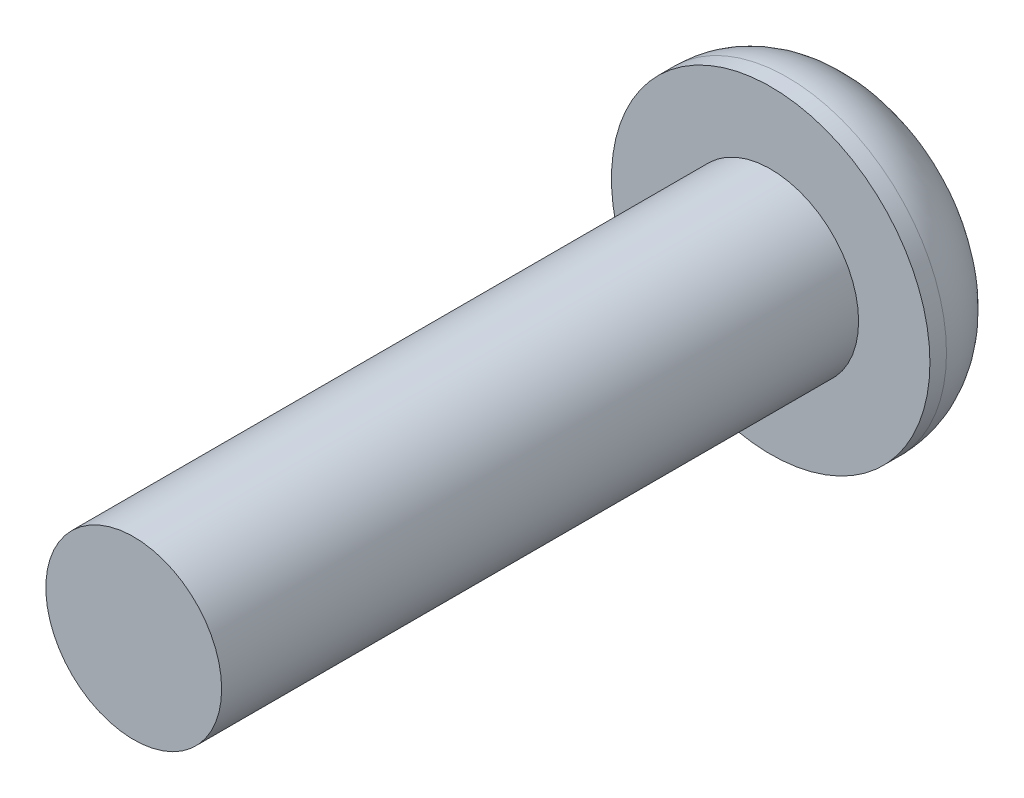
ISO-10303-21;
HEADER;
FILE_DESCRIPTION(('STEP AP214'),'2;1');
FILE_NAME('part.step','',(''),(''),'','','');
FILE_SCHEMA(('AUTOMOTIVE_DESIGN { 1 0 10303 214 1 1 1 1 }'));
ENDSEC;
DATA;
#1=APPLICATION_CONTEXT('core data for automotive mechanical design processes');
#2=APPLICATION_PROTOCOL_DEFINITION('international standard','automotive_design',2000,#1);
#3=PRODUCT_CONTEXT('',#1,'mechanical');
#4=PRODUCT('Part','Part','',(#3));
#5=PRODUCT_RELATED_PRODUCT_CATEGORY('part','',(#4));
#6=PRODUCT_DEFINITION_FORMATION('','',#4);
#7=PRODUCT_DEFINITION_CONTEXT('part definition',#1,'design');
#8=PRODUCT_DEFINITION('design','',#6,#7);
#9=PRODUCT_DEFINITION_SHAPE('','',#8);
#10=(LENGTH_UNIT() NAMED_UNIT(*) SI_UNIT(.MILLI.,.METRE.));
#11=(NAMED_UNIT(*) PLANE_ANGLE_UNIT() SI_UNIT($,.RADIAN.));
#12=(NAMED_UNIT(*) SI_UNIT($,.STERADIAN.) SOLID_ANGLE_UNIT());
#13=UNCERTAINTY_MEASURE_WITH_UNIT(LENGTH_MEASURE(1.E-05),#10,'distance_accuracy_value','');
#14=(GEOMETRIC_REPRESENTATION_CONTEXT(3) GLOBAL_UNCERTAINTY_ASSIGNED_CONTEXT((#13)) GLOBAL_UNIT_ASSIGNED_CONTEXT((#10,
#11,#12)) REPRESENTATION_CONTEXT('',''));
#15=CARTESIAN_POINT('',(0.,0.,0.));
#16=DIRECTION('',(0.,0.,1.));
#17=DIRECTION('',(1.,0.,0.));
#18=AXIS2_PLACEMENT_3D('',#15,#16,#17);
#19=CARTESIAN_POINT('',(0.,0.,1.8542));
#20=DIRECTION('',(0.,0.,1.));
#21=DIRECTION('',(1.,0.,0.));
#22=AXIS2_PLACEMENT_3D('',#19,#20,#21);
#23=PLANE('',#22);
#24=CARTESIAN_POINT('',(0.,0.,1.8542));
#25=DIRECTION('',(0.,0.,1.));
#26=DIRECTION('',(1.,0.,0.));
#27=AXIS2_PLACEMENT_3D('',#24,#25,#26);
#28=CIRCLE('',#27,3.175);
#29=CARTESIAN_POINT('',(3.175,0.,1.8542));
#30=VERTEX_POINT('',#29);
#31=EDGE_CURVE('E142',#30,#30,#28,.T.);
#32=ORIENTED_EDGE('',*,*,#31,.T.);
#33=EDGE_LOOP('',(#32));
#34=FACE_BOUND('',#33,.T.);
#35=CARTESIAN_POINT('',(0.,0.,1.8542));
#36=DIRECTION('',(0.,0.,1.));
#37=DIRECTION('',(1.,0.,0.));
#38=AXIS2_PLACEMENT_3D('',#35,#36,#37);
#39=CIRCLE('',#38,1.7526);
#40=CARTESIAN_POINT('',(1.7526,0.,1.8542));
#41=VERTEX_POINT('',#40);
#42=EDGE_CURVE('E133',#41,#41,#39,.T.);
#43=ORIENTED_EDGE('',*,*,#42,.F.);
#44=EDGE_LOOP('',(#43));
#45=FACE_BOUND('',#44,.T.);
#46=ADVANCED_FACE('F31',(#34,#45),#23,.T.);
#47=CARTESIAN_POINT('',(0.,0.,1.8542));
#48=DIRECTION('',(0.,0.,-1.));
#49=DIRECTION('',(-1.,0.,0.));
#50=AXIS2_PLACEMENT_3D('',#47,#48,#49);
#51=CYLINDRICAL_SURFACE('',#50,3.175);
#52=CARTESIAN_POINT('',(0.,0.,1.524));
#53=DIRECTION('',(0.,0.,1.));
#54=DIRECTION('',(1.,0.,0.));
#55=AXIS2_PLACEMENT_3D('',#52,#53,#54);
#56=CIRCLE('',#55,3.175);
#57=CARTESIAN_POINT('',(3.175,0.,1.524));
#58=VERTEX_POINT('',#57);
#59=EDGE_CURVE('E39',#58,#58,#56,.T.);
#60=ORIENTED_EDGE('',*,*,#59,.T.);
#61=EDGE_LOOP('',(#60));
#62=FACE_BOUND('',#61,.T.);
#63=ORIENTED_EDGE('',*,*,#31,.F.);
#64=EDGE_LOOP('',(#63));
#65=FACE_BOUND('',#64,.T.);
#66=ADVANCED_FACE('F149',(#62,#65),#51,.T.);
#67=CARTESIAN_POINT('',(0.,0.,0.));
#68=DIRECTION('',(0.,0.,1.));
#69=DIRECTION('',(1.,0.,0.));
#70=AXIS2_PLACEMENT_3D('',#67,#68,#69);
#71=PLANE('',#70);
#72=DIRECTION('',(0.999833415798117,0.0182521410653724,0.));
#73=VECTOR('',#72,1.);
#74=CARTESIAN_POINT('',(-0.590853840377281,0.981566665856041,0.));
#75=LINE('',#74,#73);
#76=CARTESIAN_POINT('',(-0.590853840377281,0.981566665856041,0.));
#77=VERTEX_POINT('',#76);
#78=CARTESIAN_POINT('',(0.554634747950682,1.00247776861834,0.));
#79=VERTEX_POINT('',#78);
#80=EDGE_CURVE('E120',#77,#79,#75,.T.);
#81=ORIENTED_EDGE('',*,*,#80,.F.);
#82=DIRECTION('',(0.484109890062989,0.875007208166425,0.));
#83=VECTOR('',#82,1.);
#84=CARTESIAN_POINT('',(-1.14548858832796,-0.020911102762301,0.));
#85=LINE('',#84,#83);
#86=CARTESIAN_POINT('',(-1.14548858832796,-0.020911102762301,0.));
#87=VERTEX_POINT('',#86);
#88=EDGE_CURVE('E46',#87,#77,#85,.T.);
#89=ORIENTED_EDGE('',*,*,#88,.F.);
#90=DIRECTION('',(-0.515723525735128,0.856755067101052,0.));
#91=VECTOR('',#90,1.);
#92=CARTESIAN_POINT('',(-0.554634747950683,-1.00247776861834,0.));
#93=LINE('',#92,#91);
#94=CARTESIAN_POINT('',(-0.554634747950683,-1.00247776861834,0.));
#95=VERTEX_POINT('',#94);
#96=EDGE_CURVE('E129',#95,#87,#93,.T.);
#97=ORIENTED_EDGE('',*,*,#96,.F.);
#98=DIRECTION('',(-0.999833415798117,-0.0182521410653724,0.));
#99=VECTOR('',#98,1.);
#100=CARTESIAN_POINT('',(0.59085384037728,-0.981566665856041,0.));
#101=LINE('',#100,#99);
#102=CARTESIAN_POINT('',(0.59085384037728,-0.981566665856041,0.));
#103=VERTEX_POINT('',#102);
#104=EDGE_CURVE('E127',#103,#95,#101,.T.);
#105=ORIENTED_EDGE('',*,*,#104,.F.);
#106=DIRECTION('',(-0.484109890062989,-0.875007208166425,0.));
#107=VECTOR('',#106,1.);
#108=CARTESIAN_POINT('',(1.14548858832796,0.0209111027623002,0.));
#109=LINE('',#108,#107);
#110=CARTESIAN_POINT('',(1.14548858832796,0.0209111027623002,0.));
#111=VERTEX_POINT('',#110);
#112=EDGE_CURVE('E94',#111,#103,#109,.T.);
#113=ORIENTED_EDGE('',*,*,#112,.F.);
#114=DIRECTION('',(0.515723525735128,-0.856755067101053,0.));
#115=VECTOR('',#114,1.);
#116=CARTESIAN_POINT('',(0.554634747950682,1.00247776861834,0.));
#117=LINE('',#116,#115);
#118=EDGE_CURVE('E123',#79,#111,#117,.T.);
#119=ORIENTED_EDGE('',*,*,#118,.F.);
#120=EDGE_LOOP('',(#81,#89,#97,#105,#113,#119));
#121=FACE_BOUND('',#120,.T.);
#122=CARTESIAN_POINT('',(0.,0.,0.));
#123=DIRECTION('',(0.,0.,1.));
#124=DIRECTION('',(1.,0.,0.));
#125=AXIS2_PLACEMENT_3D('',#122,#123,#124);
#126=CIRCLE('',#125,1.651);
#127=CARTESIAN_POINT('',(1.651,0.,0.));
#128=VERTEX_POINT('',#127);
#129=EDGE_CURVE('E11',#128,#128,#126,.F.);
#130=ORIENTED_EDGE('',*,*,#129,.T.);
#131=EDGE_LOOP('',(#130));
#132=FACE_BOUND('',#131,.T.);
#133=ADVANCED_FACE('F154',(#121,#132),#71,.F.);
#134=CARTESIAN_POINT('',(0.,0.,1.524));
#135=DIRECTION('',(0.,0.,1.));
#136=DIRECTION('',(1.,0.,0.));
#137=AXIS2_PLACEMENT_3D('',#134,#135,#136);
#138=TOROIDAL_SURFACE('',#137,1.651,1.524);
#139=ORIENTED_EDGE('',*,*,#129,.F.);
#140=EDGE_LOOP('',(#139));
#141=FACE_BOUND('',#140,.T.);
#142=ORIENTED_EDGE('',*,*,#59,.F.);
#143=EDGE_LOOP('',(#142));
#144=FACE_BOUND('',#143,.T.);
#145=ADVANCED_FACE('F33',(#141,#144),#138,.T.);
#146=CARTESIAN_POINT('',(0.,0.,14.5542));
#147=DIRECTION('',(0.,0.,-1.));
#148=DIRECTION('',(-1.,0.,0.));
#149=AXIS2_PLACEMENT_3D('',#146,#147,#148);
#150=CYLINDRICAL_SURFACE('',#149,1.7526);
#151=CARTESIAN_POINT('',(0.,0.,14.5542));
#152=DIRECTION('',(0.,0.,1.));
#153=DIRECTION('',(1.,0.,0.));
#154=AXIS2_PLACEMENT_3D('',#151,#152,#153);
#155=CIRCLE('',#154,1.7526);
#156=CARTESIAN_POINT('',(1.7526,0.,14.5542));
#157=VERTEX_POINT('',#156);
#158=EDGE_CURVE('E139',#157,#157,#155,.T.);
#159=ORIENTED_EDGE('',*,*,#158,.F.);
#160=EDGE_LOOP('',(#159));
#161=FACE_BOUND('',#160,.T.);
#162=ORIENTED_EDGE('',*,*,#42,.T.);
#163=EDGE_LOOP('',(#162));
#164=FACE_BOUND('',#163,.T.);
#165=ADVANCED_FACE('F153',(#161,#164),#150,.T.);
#166=CARTESIAN_POINT('',(0.,0.,14.5542));
#167=DIRECTION('',(0.,0.,1.));
#168=DIRECTION('',(1.,0.,0.));
#169=AXIS2_PLACEMENT_3D('',#166,#167,#168);
#170=PLANE('',#169);
#171=ORIENTED_EDGE('',*,*,#158,.T.);
#172=EDGE_LOOP('',(#171));
#173=FACE_BOUND('',#172,.T.);
#174=ADVANCED_FACE('F160',(#173),#170,.T.);
#175=CARTESIAN_POINT('',(-1.14548858832796,-0.020911102762301,1.016));
#176=DIRECTION('',(-0.875007208166425,0.484109890062989,0.));
#177=DIRECTION('',(-0.484109890062989,-0.875007208166425,0.));
#178=AXIS2_PLACEMENT_3D('',#175,#176,#177);
#179=PLANE('',#178);
#180=ORIENTED_EDGE('',*,*,#88,.T.);
#181=DIRECTION('',(0.,0.,-1.));
#182=VECTOR('',#181,1.);
#183=CARTESIAN_POINT('',(-0.590853840377281,0.981566665856041,1.016));
#184=LINE('',#183,#182);
#185=CARTESIAN_POINT('',(-0.590853840377281,0.981566665856041,1.016));
#186=VERTEX_POINT('',#185);
#187=EDGE_CURVE('E76',#186,#77,#184,.T.);
#188=ORIENTED_EDGE('',*,*,#187,.F.);
#189=DIRECTION('',(0.484109890062989,0.875007208166425,0.));
#190=VECTOR('',#189,1.);
#191=CARTESIAN_POINT('',(-1.14548858832796,-0.020911102762301,1.016));
#192=LINE('',#191,#190);
#193=CARTESIAN_POINT('',(-1.14548858832796,-0.020911102762301,1.016));
#194=VERTEX_POINT('',#193);
#195=EDGE_CURVE('E131',#194,#186,#192,.T.);
#196=ORIENTED_EDGE('',*,*,#195,.F.);
#197=DIRECTION('',(0.,0.,-1.));
#198=VECTOR('',#197,1.);
#199=CARTESIAN_POINT('',(-1.14548858832796,-0.020911102762301,1.016));
#200=LINE('',#199,#198);
#201=EDGE_CURVE('E54',#194,#87,#200,.T.);
#202=ORIENTED_EDGE('',*,*,#201,.T.);
#203=EDGE_LOOP('',(#180,#188,#196,#202));
#204=FACE_BOUND('',#203,.T.);
#205=ADVANCED_FACE('F176',(#204),#179,.F.);
#206=CARTESIAN_POINT('',(-0.554634747950683,-1.00247776861834,1.016));
#207=DIRECTION('',(-0.856755067101052,-0.515723525735128,0.));
#208=DIRECTION('',(0.515723525735128,-0.856755067101052,0.));
#209=AXIS2_PLACEMENT_3D('',#206,#207,#208);
#210=PLANE('',#209);
#211=ORIENTED_EDGE('',*,*,#96,.T.);
#212=ORIENTED_EDGE('',*,*,#201,.F.);
#213=DIRECTION('',(-0.515723525735128,0.856755067101052,0.));
#214=VECTOR('',#213,1.);
#215=CARTESIAN_POINT('',(-0.554634747950683,-1.00247776861834,1.016));
#216=LINE('',#215,#214);
#217=CARTESIAN_POINT('',(-0.554634747950683,-1.00247776861834,1.016));
#218=VERTEX_POINT('',#217);
#219=EDGE_CURVE('E106',#218,#194,#216,.T.);
#220=ORIENTED_EDGE('',*,*,#219,.F.);
#221=DIRECTION('',(0.,0.,-1.));
#222=VECTOR('',#221,1.);
#223=CARTESIAN_POINT('',(-0.554634747950683,-1.00247776861834,1.016));
#224=LINE('',#223,#222);
#225=EDGE_CURVE('E98',#218,#95,#224,.T.);
#226=ORIENTED_EDGE('',*,*,#225,.T.);
#227=EDGE_LOOP('',(#211,#212,#220,#226));
#228=FACE_BOUND('',#227,.T.);
#229=ADVANCED_FACE('F180',(#228),#210,.F.);
#230=CARTESIAN_POINT('',(0.59085384037728,-0.981566665856041,1.016));
#231=DIRECTION('',(0.0182521410653724,-0.999833415798117,0.));
#232=DIRECTION('',(0.999833415798117,0.0182521410653724,0.));
#233=AXIS2_PLACEMENT_3D('',#230,#231,#232);
#234=PLANE('',#233);
#235=ORIENTED_EDGE('',*,*,#104,.T.);
#236=ORIENTED_EDGE('',*,*,#225,.F.);
#237=DIRECTION('',(-0.999833415798117,-0.0182521410653724,0.));
#238=VECTOR('',#237,1.);
#239=CARTESIAN_POINT('',(0.59085384037728,-0.981566665856041,1.016));
#240=LINE('',#239,#238);
#241=CARTESIAN_POINT('',(0.59085384037728,-0.981566665856041,1.016));
#242=VERTEX_POINT('',#241);
#243=EDGE_CURVE('E102',#242,#218,#240,.T.);
#244=ORIENTED_EDGE('',*,*,#243,.F.);
#245=DIRECTION('',(0.,0.,-1.));
#246=VECTOR('',#245,1.);
#247=CARTESIAN_POINT('',(0.59085384037728,-0.981566665856041,1.016));
#248=LINE('',#247,#246);
#249=EDGE_CURVE('E87',#242,#103,#248,.T.);
#250=ORIENTED_EDGE('',*,*,#249,.T.);
#251=EDGE_LOOP('',(#235,#236,#244,#250));
#252=FACE_BOUND('',#251,.T.);
#253=ADVANCED_FACE('F103',(#252),#234,.F.);
#254=CARTESIAN_POINT('',(1.14548858832796,0.0209111027623002,1.016));
#255=DIRECTION('',(0.875007208166425,-0.484109890062989,0.));
#256=DIRECTION('',(0.484109890062989,0.875007208166425,0.));
#257=AXIS2_PLACEMENT_3D('',#254,#255,#256);
#258=PLANE('',#257);
#259=ORIENTED_EDGE('',*,*,#112,.T.);
#260=ORIENTED_EDGE('',*,*,#249,.F.);
#261=DIRECTION('',(-0.484109890062989,-0.875007208166425,0.));
#262=VECTOR('',#261,1.);
#263=CARTESIAN_POINT('',(1.14548858832796,0.0209111027623002,1.016));
#264=LINE('',#263,#262);
#265=CARTESIAN_POINT('',(1.14548858832796,0.0209111027623002,1.016));
#266=VERTEX_POINT('',#265);
#267=EDGE_CURVE('E91',#266,#242,#264,.T.);
#268=ORIENTED_EDGE('',*,*,#267,.F.);
#269=DIRECTION('',(0.,0.,-1.));
#270=VECTOR('',#269,1.);
#271=CARTESIAN_POINT('',(1.14548858832796,0.0209111027623002,1.016));
#272=LINE('',#271,#270);
#273=EDGE_CURVE('E99',#266,#111,#272,.T.);
#274=ORIENTED_EDGE('',*,*,#273,.T.);
#275=EDGE_LOOP('',(#259,#260,#268,#274));
#276=FACE_BOUND('',#275,.T.);
#277=ADVANCED_FACE('F89',(#276),#258,.F.);
#278=CARTESIAN_POINT('',(0.554634747950682,1.00247776861834,1.016));
#279=DIRECTION('',(0.856755067101053,0.515723525735128,0.));
#280=DIRECTION('',(-0.515723525735128,0.856755067101052,0.));
#281=AXIS2_PLACEMENT_3D('',#278,#279,#280);
#282=PLANE('',#281);
#283=ORIENTED_EDGE('',*,*,#118,.T.);
#284=ORIENTED_EDGE('',*,*,#273,.F.);
#285=DIRECTION('',(0.515723525735128,-0.856755067101053,0.));
#286=VECTOR('',#285,1.);
#287=CARTESIAN_POINT('',(0.554634747950682,1.00247776861834,1.016));
#288=LINE('',#287,#286);
#289=CARTESIAN_POINT('',(0.554634747950682,1.00247776861834,1.016));
#290=VERTEX_POINT('',#289);
#291=EDGE_CURVE('E112',#290,#266,#288,.T.);
#292=ORIENTED_EDGE('',*,*,#291,.F.);
#293=DIRECTION('',(0.,0.,-1.));
#294=VECTOR('',#293,1.);
#295=CARTESIAN_POINT('',(0.554634747950682,1.00247776861834,1.016));
#296=LINE('',#295,#294);
#297=EDGE_CURVE('E136',#290,#79,#296,.T.);
#298=ORIENTED_EDGE('',*,*,#297,.T.);
#299=EDGE_LOOP('',(#283,#284,#292,#298));
#300=FACE_BOUND('',#299,.T.);
#301=ADVANCED_FACE('F184',(#300),#282,.F.);
#302=CARTESIAN_POINT('',(-0.590853840377281,0.981566665856041,1.016));
#303=DIRECTION('',(-0.0182521410653723,0.999833415798117,0.));
#304=DIRECTION('',(-0.999833415798117,-0.0182521410653724,0.));
#305=AXIS2_PLACEMENT_3D('',#302,#303,#304);
#306=PLANE('',#305);
#307=ORIENTED_EDGE('',*,*,#80,.T.);
#308=ORIENTED_EDGE('',*,*,#297,.F.);
#309=DIRECTION('',(0.999833415798117,0.0182521410653724,0.));
#310=VECTOR('',#309,1.);
#311=CARTESIAN_POINT('',(-0.590853840377281,0.981566665856041,1.016));
#312=LINE('',#311,#310);
#313=EDGE_CURVE('E114',#186,#290,#312,.T.);
#314=ORIENTED_EDGE('',*,*,#313,.F.);
#315=ORIENTED_EDGE('',*,*,#187,.T.);
#316=EDGE_LOOP('',(#307,#308,#314,#315));
#317=FACE_BOUND('',#316,.T.);
#318=ADVANCED_FACE('F181',(#317),#306,.F.);
#319=CARTESIAN_POINT('',(-0.590853840377281,0.981566665856041,1.016));
#320=DIRECTION('',(0.,0.,-1.));
#321=DIRECTION('',(-1.,0.,0.));
#322=AXIS2_PLACEMENT_3D('',#319,#320,#321);
#323=PLANE('',#322);
#324=ORIENTED_EDGE('',*,*,#195,.T.);
#325=ORIENTED_EDGE('',*,*,#313,.T.);
#326=ORIENTED_EDGE('',*,*,#291,.T.);
#327=ORIENTED_EDGE('',*,*,#267,.T.);
#328=ORIENTED_EDGE('',*,*,#243,.T.);
#329=ORIENTED_EDGE('',*,*,#219,.T.);
#330=EDGE_LOOP('',(#324,#325,#326,#327,#328,#329));
#331=FACE_BOUND('',#330,.T.);
#332=ADVANCED_FACE('F109',(#331),#323,.T.);
#333=CLOSED_SHELL('',(#46,#66,#133,#145,#165,#174,#205,#229,#253,#277,#301,#318,#332));
#334=MANIFOLD_SOLID_BREP('B2',#333);
#335=ADVANCED_BREP_SHAPE_REPRESENTATION('',(#18,#334),#14);
#336=SHAPE_DEFINITION_REPRESENTATION(#9,#335);
ENDSEC;
END-ISO-10303-21;
